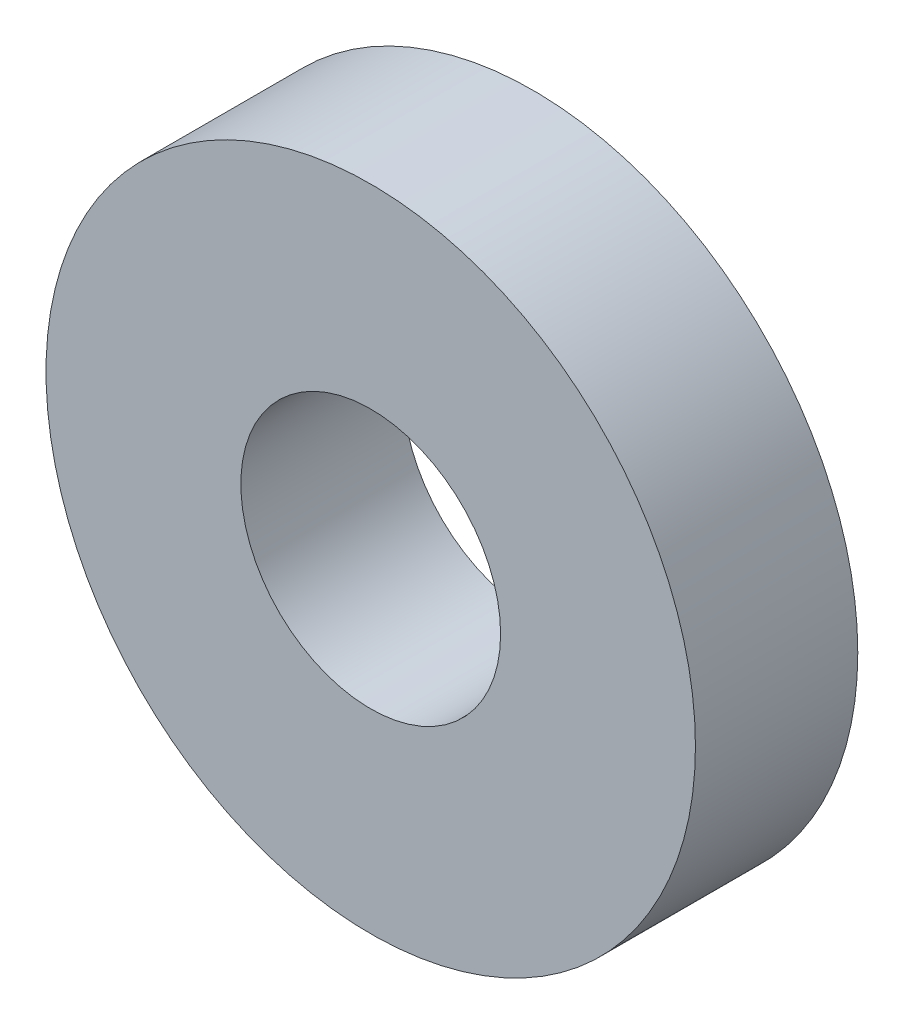
ISO-10303-21;
HEADER;
FILE_DESCRIPTION(('STEP AP214'),'2;1');
FILE_NAME('part.step','',(''),(''),'','','');
FILE_SCHEMA(('AUTOMOTIVE_DESIGN { 1 0 10303 214 1 1 1 1 }'));
ENDSEC;
DATA;
#1=APPLICATION_CONTEXT('core data for automotive mechanical design processes');
#2=APPLICATION_PROTOCOL_DEFINITION('international standard','automotive_design',2000,#1);
#3=PRODUCT_CONTEXT('',#1,'mechanical');
#4=PRODUCT('Part','Part','',(#3));
#5=PRODUCT_RELATED_PRODUCT_CATEGORY('part','',(#4));
#6=PRODUCT_DEFINITION_FORMATION('','',#4);
#7=PRODUCT_DEFINITION_CONTEXT('part definition',#1,'design');
#8=PRODUCT_DEFINITION('design','',#6,#7);
#9=PRODUCT_DEFINITION_SHAPE('','',#8);
#10=(LENGTH_UNIT() NAMED_UNIT(*) SI_UNIT(.MILLI.,.METRE.));
#11=(NAMED_UNIT(*) PLANE_ANGLE_UNIT() SI_UNIT($,.RADIAN.));
#12=(NAMED_UNIT(*) SI_UNIT($,.STERADIAN.) SOLID_ANGLE_UNIT());
#13=UNCERTAINTY_MEASURE_WITH_UNIT(LENGTH_MEASURE(1.E-05),#10,'distance_accuracy_value','');
#14=(GEOMETRIC_REPRESENTATION_CONTEXT(3) GLOBAL_UNCERTAINTY_ASSIGNED_CONTEXT((#13)) GLOBAL_UNIT_ASSIGNED_CONTEXT((#10,
#11,#12)) REPRESENTATION_CONTEXT('',''));
#15=CARTESIAN_POINT('',(0.,0.,0.));
#16=DIRECTION('',(0.,0.,1.));
#17=DIRECTION('',(1.,0.,0.));
#18=AXIS2_PLACEMENT_3D('',#15,#16,#17);
#19=CARTESIAN_POINT('',(0.,0.,2.5));
#20=DIRECTION('',(0.,0.,1.));
#21=DIRECTION('',(1.,0.,0.));
#22=AXIS2_PLACEMENT_3D('',#19,#20,#21);
#23=PLANE('',#22);
#24=CARTESIAN_POINT('',(0.,0.,2.5));
#25=DIRECTION('',(0.,0.,1.));
#26=DIRECTION('',(1.,0.,0.));
#27=AXIS2_PLACEMENT_3D('',#24,#25,#26);
#28=CIRCLE('',#27,5.);
#29=CARTESIAN_POINT('',(5.,0.,2.5));
#30=VERTEX_POINT('',#29);
#31=EDGE_CURVE('E10',#30,#30,#28,.T.);
#32=ORIENTED_EDGE('',*,*,#31,.T.);
#33=EDGE_LOOP('',(#32));
#34=FACE_BOUND('',#33,.T.);
#35=CARTESIAN_POINT('',(0.,0.,2.5));
#36=DIRECTION('',(0.,0.,1.));
#37=DIRECTION('',(1.,0.,0.));
#38=AXIS2_PLACEMENT_3D('',#35,#36,#37);
#39=CIRCLE('',#38,2.);
#40=CARTESIAN_POINT('',(2.,0.,2.5));
#41=VERTEX_POINT('',#40);
#42=EDGE_CURVE('E49',#41,#41,#39,.T.);
#43=ORIENTED_EDGE('',*,*,#42,.F.);
#44=EDGE_LOOP('',(#43));
#45=FACE_BOUND('',#44,.T.);
#46=ADVANCED_FACE('F38',(#34,#45),#23,.T.);
#47=CARTESIAN_POINT('',(0.,0.,0.));
#48=DIRECTION('',(0.,0.,1.));
#49=DIRECTION('',(1.,0.,0.));
#50=AXIS2_PLACEMENT_3D('',#47,#48,#49);
#51=PLANE('',#50);
#52=CARTESIAN_POINT('',(0.,0.,0.));
#53=DIRECTION('',(0.,0.,1.));
#54=DIRECTION('',(1.,0.,0.));
#55=AXIS2_PLACEMENT_3D('',#52,#53,#54);
#56=CIRCLE('',#55,5.);
#57=CARTESIAN_POINT('',(5.,0.,0.));
#58=VERTEX_POINT('',#57);
#59=EDGE_CURVE('E42',#58,#58,#56,.T.);
#60=ORIENTED_EDGE('',*,*,#59,.F.);
#61=EDGE_LOOP('',(#60));
#62=FACE_BOUND('',#61,.T.);
#63=CARTESIAN_POINT('',(0.,0.,0.));
#64=DIRECTION('',(0.,0.,1.));
#65=DIRECTION('',(1.,0.,0.));
#66=AXIS2_PLACEMENT_3D('',#63,#64,#65);
#67=CIRCLE('',#66,2.);
#68=CARTESIAN_POINT('',(2.,0.,0.));
#69=VERTEX_POINT('',#68);
#70=EDGE_CURVE('E51',#69,#69,#67,.T.);
#71=ORIENTED_EDGE('',*,*,#70,.T.);
#72=EDGE_LOOP('',(#71));
#73=FACE_BOUND('',#72,.T.);
#74=ADVANCED_FACE('F61',(#62,#73),#51,.F.);
#75=CARTESIAN_POINT('',(0.,0.,2.5));
#76=DIRECTION('',(0.,0.,-1.));
#77=DIRECTION('',(-1.,0.,0.));
#78=AXIS2_PLACEMENT_3D('',#75,#76,#77);
#79=CYLINDRICAL_SURFACE('',#78,5.);
#80=ORIENTED_EDGE('',*,*,#31,.F.);
#81=EDGE_LOOP('',(#80));
#82=FACE_BOUND('',#81,.T.);
#83=ORIENTED_EDGE('',*,*,#59,.T.);
#84=EDGE_LOOP('',(#83));
#85=FACE_BOUND('',#84,.T.);
#86=ADVANCED_FACE('F40',(#82,#85),#79,.T.);
#87=CARTESIAN_POINT('',(0.,0.,2.5));
#88=DIRECTION('',(0.,0.,-1.));
#89=DIRECTION('',(-1.,0.,0.));
#90=AXIS2_PLACEMENT_3D('',#87,#88,#89);
#91=CYLINDRICAL_SURFACE('',#90,2.);
#92=ORIENTED_EDGE('',*,*,#42,.T.);
#93=EDGE_LOOP('',(#92));
#94=FACE_BOUND('',#93,.T.);
#95=ORIENTED_EDGE('',*,*,#70,.F.);
#96=EDGE_LOOP('',(#95));
#97=FACE_BOUND('',#96,.T.);
#98=ADVANCED_FACE('F57',(#94,#97),#91,.F.);
#99=CLOSED_SHELL('',(#46,#74,#86,#98));
#100=MANIFOLD_SOLID_BREP('B2',#99);
#101=ADVANCED_BREP_SHAPE_REPRESENTATION('',(#18,#100),#14);
#102=SHAPE_DEFINITION_REPRESENTATION(#9,#101);
ENDSEC;
END-ISO-10303-21;
